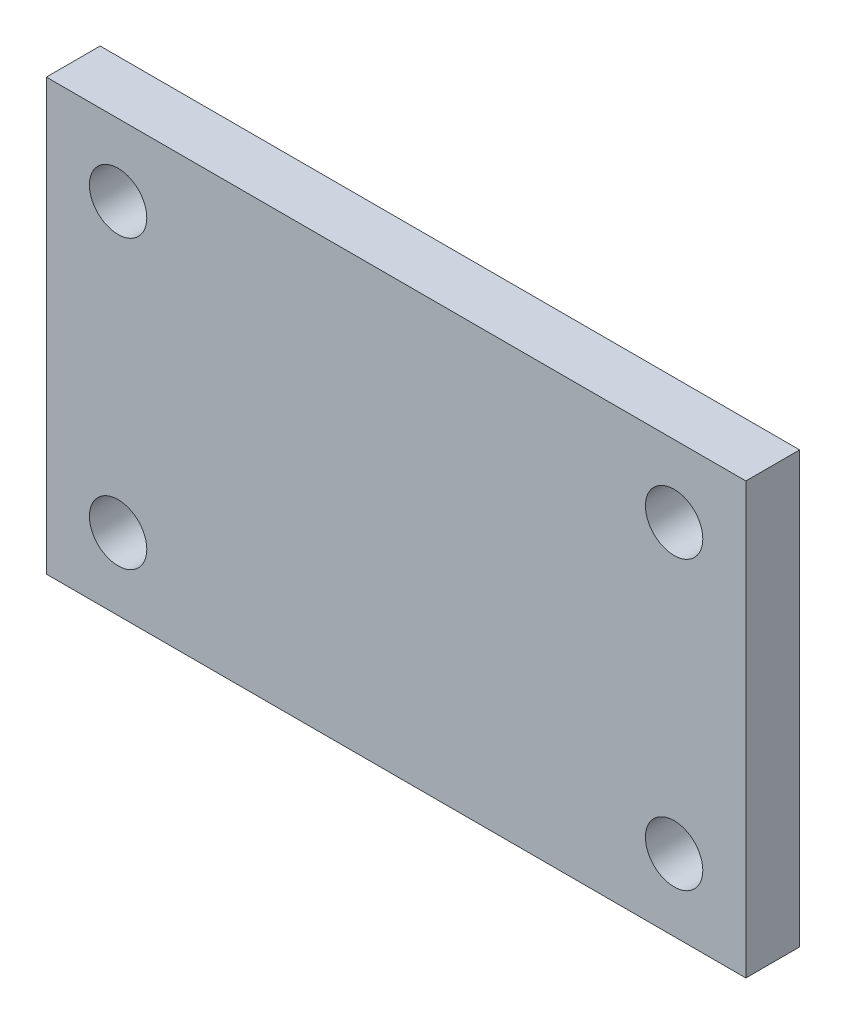
ISO-10303-21;
HEADER;
FILE_DESCRIPTION(('STEP AP214'),'2;1');
FILE_NAME('part.step','',(''),(''),'','','');
FILE_SCHEMA(('AUTOMOTIVE_DESIGN { 1 0 10303 214 1 1 1 1 }'));
ENDSEC;
DATA;
#1=APPLICATION_CONTEXT('core data for automotive mechanical design processes');
#2=APPLICATION_PROTOCOL_DEFINITION('international standard','automotive_design',2000,#1);
#3=PRODUCT_CONTEXT('',#1,'mechanical');
#4=PRODUCT('Part','Part','',(#3));
#5=PRODUCT_RELATED_PRODUCT_CATEGORY('part','',(#4));
#6=PRODUCT_DEFINITION_FORMATION('','',#4);
#7=PRODUCT_DEFINITION_CONTEXT('part definition',#1,'design');
#8=PRODUCT_DEFINITION('design','',#6,#7);
#9=PRODUCT_DEFINITION_SHAPE('','',#8);
#10=(LENGTH_UNIT() NAMED_UNIT(*) SI_UNIT(.MILLI.,.METRE.));
#11=(NAMED_UNIT(*) PLANE_ANGLE_UNIT() SI_UNIT($,.RADIAN.));
#12=(NAMED_UNIT(*) SI_UNIT($,.STERADIAN.) SOLID_ANGLE_UNIT());
#13=UNCERTAINTY_MEASURE_WITH_UNIT(LENGTH_MEASURE(1.E-05),#10,'distance_accuracy_value','');
#14=(GEOMETRIC_REPRESENTATION_CONTEXT(3) GLOBAL_UNCERTAINTY_ASSIGNED_CONTEXT((#13)) GLOBAL_UNIT_ASSIGNED_CONTEXT((#10,
#11,#12)) REPRESENTATION_CONTEXT('',''));
#15=CARTESIAN_POINT('',(0.,0.,0.));
#16=DIRECTION('',(0.,0.,1.));
#17=DIRECTION('',(1.,0.,0.));
#18=AXIS2_PLACEMENT_3D('',#15,#16,#17);
#19=CARTESIAN_POINT('',(0.,10.,3.));
#20=DIRECTION('',(0.,1.,0.));
#21=DIRECTION('',(0.,0.,1.));
#22=AXIS2_PLACEMENT_3D('',#19,#20,#21);
#23=PLANE('',#22);
#24=DIRECTION('',(1.,0.,0.));
#25=VECTOR('',#24,1.);
#26=CARTESIAN_POINT('',(0.,10.,0.));
#27=LINE('',#26,#25);
#28=CARTESIAN_POINT('',(-19.5,10.,0.));
#29=VERTEX_POINT('',#28);
#30=CARTESIAN_POINT('',(19.5,10.,0.));
#31=VERTEX_POINT('',#30);
#32=EDGE_CURVE('E252',#29,#31,#27,.T.);
#33=ORIENTED_EDGE('',*,*,#32,.F.);
#34=DIRECTION('',(0.,0.,-1.));
#35=VECTOR('',#34,1.);
#36=CARTESIAN_POINT('',(-19.5,10.,3.));
#37=LINE('',#36,#35);
#38=CARTESIAN_POINT('',(-19.5,10.,3.));
#39=VERTEX_POINT('',#38);
#40=EDGE_CURVE('E223',#39,#29,#37,.T.);
#41=ORIENTED_EDGE('',*,*,#40,.F.);
#42=DIRECTION('',(1.,0.,0.));
#43=VECTOR('',#42,1.);
#44=CARTESIAN_POINT('',(0.,10.,3.));
#45=LINE('',#44,#43);
#46=CARTESIAN_POINT('',(19.5,10.,3.));
#47=VERTEX_POINT('',#46);
#48=EDGE_CURVE('E246',#39,#47,#45,.T.);
#49=ORIENTED_EDGE('',*,*,#48,.T.);
#50=DIRECTION('',(0.,0.,-1.));
#51=VECTOR('',#50,1.);
#52=CARTESIAN_POINT('',(19.5,10.,3.));
#53=LINE('',#52,#51);
#54=EDGE_CURVE('E12',#47,#31,#53,.T.);
#55=ORIENTED_EDGE('',*,*,#54,.T.);
#56=EDGE_LOOP('',(#33,#41,#49,#55));
#57=FACE_BOUND('',#56,.T.);
#58=ADVANCED_FACE('F219',(#57),#23,.T.);
#59=CARTESIAN_POINT('',(0.,0.,0.));
#60=DIRECTION('',(0.,0.,1.));
#61=DIRECTION('',(1.,0.,0.));
#62=AXIS2_PLACEMENT_3D('',#59,#60,#61);
#63=PLANE('',#62);
#64=CARTESIAN_POINT('',(-15.5,-10.,0.));
#65=DIRECTION('',(0.,0.,1.));
#66=DIRECTION('',(1.,0.,0.));
#67=AXIS2_PLACEMENT_3D('',#64,#65,#66);
#68=CIRCLE('',#67,1.6);
#69=CARTESIAN_POINT('',(-13.9,-10.,0.));
#70=VERTEX_POINT('',#69);
#71=EDGE_CURVE('E287',#70,#70,#68,.T.);
#72=ORIENTED_EDGE('',*,*,#71,.T.);
#73=EDGE_LOOP('',(#72));
#74=FACE_BOUND('',#73,.T.);
#75=CARTESIAN_POINT('',(15.5,-10.,0.));
#76=DIRECTION('',(0.,0.,1.));
#77=DIRECTION('',(1.,0.,0.));
#78=AXIS2_PLACEMENT_3D('',#75,#76,#77);
#79=CIRCLE('',#78,1.6);
#80=CARTESIAN_POINT('',(17.1,-10.,0.));
#81=VERTEX_POINT('',#80);
#82=EDGE_CURVE('E290',#81,#81,#79,.T.);
#83=ORIENTED_EDGE('',*,*,#82,.T.);
#84=EDGE_LOOP('',(#83));
#85=FACE_BOUND('',#84,.T.);
#86=CARTESIAN_POINT('',(-15.5,6.,0.));
#87=DIRECTION('',(0.,0.,1.));
#88=DIRECTION('',(1.,0.,0.));
#89=AXIS2_PLACEMENT_3D('',#86,#87,#88);
#90=CIRCLE('',#89,1.6);
#91=CARTESIAN_POINT('',(-13.9,6.,0.));
#92=VERTEX_POINT('',#91);
#93=EDGE_CURVE('E276',#92,#92,#90,.T.);
#94=ORIENTED_EDGE('',*,*,#93,.T.);
#95=EDGE_LOOP('',(#94));
#96=FACE_BOUND('',#95,.T.);
#97=CARTESIAN_POINT('',(15.5,6.,0.));
#98=DIRECTION('',(0.,0.,1.));
#99=DIRECTION('',(1.,0.,0.));
#100=AXIS2_PLACEMENT_3D('',#97,#98,#99);
#101=CIRCLE('',#100,1.6);
#102=CARTESIAN_POINT('',(17.1,6.,0.));
#103=VERTEX_POINT('',#102);
#104=EDGE_CURVE('E304',#103,#103,#101,.T.);
#105=ORIENTED_EDGE('',*,*,#104,.T.);
#106=EDGE_LOOP('',(#105));
#107=FACE_BOUND('',#106,.T.);
#108=DIRECTION('',(0.,-1.,0.));
#109=VECTOR('',#108,1.);
#110=CARTESIAN_POINT('',(19.5,0.,0.));
#111=LINE('',#110,#109);
#112=CARTESIAN_POINT('',(19.5,-14.,0.));
#113=VERTEX_POINT('',#112);
#114=EDGE_CURVE('E281',#31,#113,#111,.T.);
#115=ORIENTED_EDGE('',*,*,#114,.T.);
#116=DIRECTION('',(1.,0.,0.));
#117=VECTOR('',#116,1.);
#118=CARTESIAN_POINT('',(-19.5,-14.,0.));
#119=LINE('',#118,#117);
#120=CARTESIAN_POINT('',(-19.5,-14.,0.));
#121=VERTEX_POINT('',#120);
#122=EDGE_CURVE('E279',#121,#113,#119,.T.);
#123=ORIENTED_EDGE('',*,*,#122,.F.);
#124=DIRECTION('',(0.,-1.,0.));
#125=VECTOR('',#124,1.);
#126=CARTESIAN_POINT('',(-19.5,0.,0.));
#127=LINE('',#126,#125);
#128=EDGE_CURVE('E269',#29,#121,#127,.T.);
#129=ORIENTED_EDGE('',*,*,#128,.F.);
#130=ORIENTED_EDGE('',*,*,#32,.T.);
#131=EDGE_LOOP('',(#115,#123,#129,#130));
#132=FACE_BOUND('',#131,.T.);
#133=ADVANCED_FACE('F280',(#74,#85,#96,#107,#132),#63,.F.);
#134=CARTESIAN_POINT('',(-19.5,0.,3.));
#135=DIRECTION('',(1.,0.,0.));
#136=DIRECTION('',(0.,1.,0.));
#137=AXIS2_PLACEMENT_3D('',#134,#135,#136);
#138=PLANE('',#137);
#139=ORIENTED_EDGE('',*,*,#128,.T.);
#140=DIRECTION('',(0.,0.,-1.));
#141=VECTOR('',#140,1.);
#142=CARTESIAN_POINT('',(-19.5,-14.,0.));
#143=LINE('',#142,#141);
#144=CARTESIAN_POINT('',(-19.5,-14.,3.));
#145=VERTEX_POINT('',#144);
#146=EDGE_CURVE('E273',#145,#121,#143,.T.);
#147=ORIENTED_EDGE('',*,*,#146,.F.);
#148=DIRECTION('',(0.,-1.,0.));
#149=VECTOR('',#148,1.);
#150=CARTESIAN_POINT('',(-19.5,0.,3.));
#151=LINE('',#150,#149);
#152=EDGE_CURVE('E229',#39,#145,#151,.T.);
#153=ORIENTED_EDGE('',*,*,#152,.F.);
#154=ORIENTED_EDGE('',*,*,#40,.T.);
#155=EDGE_LOOP('',(#139,#147,#153,#154));
#156=FACE_BOUND('',#155,.T.);
#157=ADVANCED_FACE('F271',(#156),#138,.F.);
#158=CARTESIAN_POINT('',(-15.5,6.,3.));
#159=DIRECTION('',(0.,0.,-1.));
#160=DIRECTION('',(-1.,0.,0.));
#161=AXIS2_PLACEMENT_3D('',#158,#159,#160);
#162=CYLINDRICAL_SURFACE('',#161,1.6);
#163=ORIENTED_EDGE('',*,*,#93,.F.);
#164=EDGE_LOOP('',(#163));
#165=FACE_BOUND('',#164,.T.);
#166=CARTESIAN_POINT('',(-15.5,6.,3.));
#167=DIRECTION('',(0.,0.,1.));
#168=DIRECTION('',(1.,0.,0.));
#169=AXIS2_PLACEMENT_3D('',#166,#167,#168);
#170=CIRCLE('',#169,1.6);
#171=CARTESIAN_POINT('',(-13.9,6.,3.));
#172=VERTEX_POINT('',#171);
#173=EDGE_CURVE('E300',#172,#172,#170,.T.);
#174=ORIENTED_EDGE('',*,*,#173,.T.);
#175=EDGE_LOOP('',(#174));
#176=FACE_BOUND('',#175,.T.);
#177=ADVANCED_FACE('F314',(#165,#176),#162,.F.);
#178=CARTESIAN_POINT('',(15.5,6.,3.));
#179=DIRECTION('',(0.,0.,-1.));
#180=DIRECTION('',(-1.,0.,0.));
#181=AXIS2_PLACEMENT_3D('',#178,#179,#180);
#182=CYLINDRICAL_SURFACE('',#181,1.6);
#183=CARTESIAN_POINT('',(15.5,6.,3.));
#184=DIRECTION('',(0.,0.,1.));
#185=DIRECTION('',(1.,0.,0.));
#186=AXIS2_PLACEMENT_3D('',#183,#184,#185);
#187=CIRCLE('',#186,1.6);
#188=CARTESIAN_POINT('',(17.1,6.,3.));
#189=VERTEX_POINT('',#188);
#190=EDGE_CURVE('E275',#189,#189,#187,.T.);
#191=ORIENTED_EDGE('',*,*,#190,.T.);
#192=EDGE_LOOP('',(#191));
#193=FACE_BOUND('',#192,.T.);
#194=ORIENTED_EDGE('',*,*,#104,.F.);
#195=EDGE_LOOP('',(#194));
#196=FACE_BOUND('',#195,.T.);
#197=ADVANCED_FACE('F221',(#193,#196),#182,.F.);
#198=CARTESIAN_POINT('',(19.5,0.,3.));
#199=DIRECTION('',(1.,0.,0.));
#200=DIRECTION('',(0.,1.,0.));
#201=AXIS2_PLACEMENT_3D('',#198,#199,#200);
#202=PLANE('',#201);
#203=ORIENTED_EDGE('',*,*,#114,.F.);
#204=ORIENTED_EDGE('',*,*,#54,.F.);
#205=DIRECTION('',(0.,-1.,0.));
#206=VECTOR('',#205,1.);
#207=CARTESIAN_POINT('',(19.5,0.,3.));
#208=LINE('',#207,#206);
#209=CARTESIAN_POINT('',(19.5,-14.,3.));
#210=VERTEX_POINT('',#209);
#211=EDGE_CURVE('E259',#47,#210,#208,.T.);
#212=ORIENTED_EDGE('',*,*,#211,.T.);
#213=DIRECTION('',(0.,0.,1.));
#214=VECTOR('',#213,1.);
#215=CARTESIAN_POINT('',(19.5,-14.,0.));
#216=LINE('',#215,#214);
#217=EDGE_CURVE('E283',#113,#210,#216,.T.);
#218=ORIENTED_EDGE('',*,*,#217,.F.);
#219=EDGE_LOOP('',(#203,#204,#212,#218));
#220=FACE_BOUND('',#219,.T.);
#221=ADVANCED_FACE('F323',(#220),#202,.T.);
#222=CARTESIAN_POINT('',(0.,0.,3.));
#223=DIRECTION('',(0.,0.,1.));
#224=DIRECTION('',(1.,0.,0.));
#225=AXIS2_PLACEMENT_3D('',#222,#223,#224);
#226=PLANE('',#225);
#227=ORIENTED_EDGE('',*,*,#173,.F.);
#228=EDGE_LOOP('',(#227));
#229=FACE_BOUND('',#228,.T.);
#230=CARTESIAN_POINT('',(-15.5,-10.,3.));
#231=DIRECTION('',(0.,0.,1.));
#232=DIRECTION('',(1.,0.,0.));
#233=AXIS2_PLACEMENT_3D('',#230,#231,#232);
#234=CIRCLE('',#233,1.6);
#235=CARTESIAN_POINT('',(-13.9,-10.,3.));
#236=VERTEX_POINT('',#235);
#237=EDGE_CURVE('E328',#236,#236,#234,.T.);
#238=ORIENTED_EDGE('',*,*,#237,.F.);
#239=EDGE_LOOP('',(#238));
#240=FACE_BOUND('',#239,.T.);
#241=CARTESIAN_POINT('',(15.5,-10.,3.));
#242=DIRECTION('',(0.,0.,1.));
#243=DIRECTION('',(1.,0.,0.));
#244=AXIS2_PLACEMENT_3D('',#241,#242,#243);
#245=CIRCLE('',#244,1.6);
#246=CARTESIAN_POINT('',(17.1,-10.,3.));
#247=VERTEX_POINT('',#246);
#248=EDGE_CURVE('E332',#247,#247,#245,.T.);
#249=ORIENTED_EDGE('',*,*,#248,.F.);
#250=EDGE_LOOP('',(#249));
#251=FACE_BOUND('',#250,.T.);
#252=ORIENTED_EDGE('',*,*,#190,.F.);
#253=EDGE_LOOP('',(#252));
#254=FACE_BOUND('',#253,.T.);
#255=ORIENTED_EDGE('',*,*,#211,.F.);
#256=ORIENTED_EDGE('',*,*,#48,.F.);
#257=ORIENTED_EDGE('',*,*,#152,.T.);
#258=DIRECTION('',(-1.,0.,0.));
#259=VECTOR('',#258,1.);
#260=CARTESIAN_POINT('',(-19.5,-14.,3.));
#261=LINE('',#260,#259);
#262=EDGE_CURVE('E286',#210,#145,#261,.T.);
#263=ORIENTED_EDGE('',*,*,#262,.F.);
#264=EDGE_LOOP('',(#255,#256,#257,#263));
#265=FACE_BOUND('',#264,.T.);
#266=ADVANCED_FACE('F320',(#229,#240,#251,#254,#265),#226,.T.);
#267=CARTESIAN_POINT('',(0.,-14.,0.));
#268=DIRECTION('',(0.,1.,0.));
#269=DIRECTION('',(0.,0.,1.));
#270=AXIS2_PLACEMENT_3D('',#267,#268,#269);
#271=PLANE('',#270);
#272=ORIENTED_EDGE('',*,*,#146,.T.);
#273=ORIENTED_EDGE('',*,*,#122,.T.);
#274=ORIENTED_EDGE('',*,*,#217,.T.);
#275=ORIENTED_EDGE('',*,*,#262,.T.);
#276=EDGE_LOOP('',(#272,#273,#274,#275));
#277=FACE_BOUND('',#276,.T.);
#278=ADVANCED_FACE('F285',(#277),#271,.F.);
#279=CARTESIAN_POINT('',(15.5,-10.,-1.));
#280=DIRECTION('',(0.,0.,1.));
#281=DIRECTION('',(1.,0.,0.));
#282=AXIS2_PLACEMENT_3D('',#279,#280,#281);
#283=CYLINDRICAL_SURFACE('',#282,1.6);
#284=ORIENTED_EDGE('',*,*,#248,.T.);
#285=EDGE_LOOP('',(#284));
#286=FACE_BOUND('',#285,.T.);
#287=ORIENTED_EDGE('',*,*,#82,.F.);
#288=EDGE_LOOP('',(#287));
#289=FACE_BOUND('',#288,.T.);
#290=ADVANCED_FACE('F352',(#286,#289),#283,.F.);
#291=CARTESIAN_POINT('',(-15.5,-10.,-1.));
#292=DIRECTION('',(0.,0.,1.));
#293=DIRECTION('',(1.,0.,0.));
#294=AXIS2_PLACEMENT_3D('',#291,#292,#293);
#295=CYLINDRICAL_SURFACE('',#294,1.6);
#296=ORIENTED_EDGE('',*,*,#237,.T.);
#297=EDGE_LOOP('',(#296));
#298=FACE_BOUND('',#297,.T.);
#299=ORIENTED_EDGE('',*,*,#71,.F.);
#300=EDGE_LOOP('',(#299));
#301=FACE_BOUND('',#300,.T.);
#302=ADVANCED_FACE('F355',(#298,#301),#295,.F.);
#303=CLOSED_SHELL('',(#58,#133,#157,#177,#197,#221,#266,#278,#290,#302));
#304=MANIFOLD_SOLID_BREP('B2',#303);
#305=ADVANCED_BREP_SHAPE_REPRESENTATION('',(#18,#304),#14);
#306=SHAPE_DEFINITION_REPRESENTATION(#9,#305);
ENDSEC;
END-ISO-10303-21;
